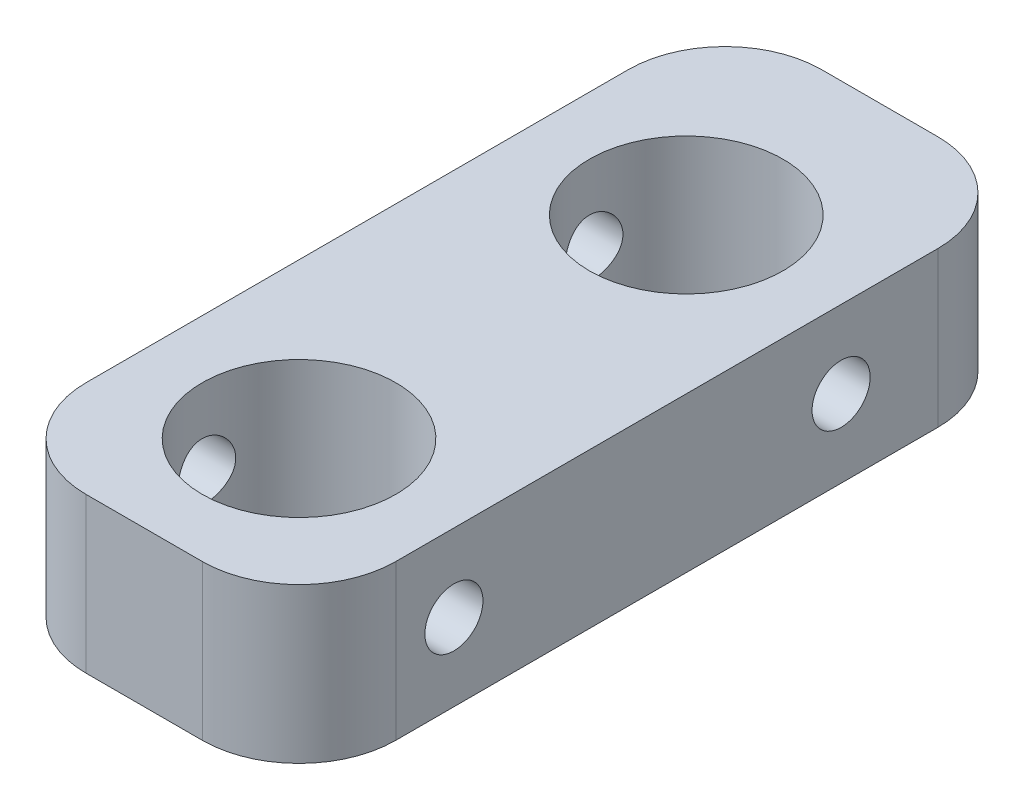
ISO-10303-21;
HEADER;
FILE_DESCRIPTION(('STEP AP214'),'2;1');
FILE_NAME('part.step','',(''),(''),'','','');
FILE_SCHEMA(('AUTOMOTIVE_DESIGN { 1 0 10303 214 1 1 1 1 }'));
ENDSEC;
DATA;
#1=APPLICATION_CONTEXT('core data for automotive mechanical design processes');
#2=APPLICATION_PROTOCOL_DEFINITION('international standard','automotive_design',2000,#1);
#3=PRODUCT_CONTEXT('',#1,'mechanical');
#4=PRODUCT('Part','Part','',(#3));
#5=PRODUCT_RELATED_PRODUCT_CATEGORY('part','',(#4));
#6=PRODUCT_DEFINITION_FORMATION('','',#4);
#7=PRODUCT_DEFINITION_CONTEXT('part definition',#1,'design');
#8=PRODUCT_DEFINITION('design','',#6,#7);
#9=PRODUCT_DEFINITION_SHAPE('','',#8);
#10=(LENGTH_UNIT() NAMED_UNIT(*) SI_UNIT(.MILLI.,.METRE.));
#11=(NAMED_UNIT(*) PLANE_ANGLE_UNIT() SI_UNIT($,.RADIAN.));
#12=(NAMED_UNIT(*) SI_UNIT($,.STERADIAN.) SOLID_ANGLE_UNIT());
#13=UNCERTAINTY_MEASURE_WITH_UNIT(LENGTH_MEASURE(1.E-05),#10,'distance_accuracy_value','');
#14=(GEOMETRIC_REPRESENTATION_CONTEXT(3) GLOBAL_UNCERTAINTY_ASSIGNED_CONTEXT((#13)) GLOBAL_UNIT_ASSIGNED_CONTEXT((#10,
#11,#12)) REPRESENTATION_CONTEXT('',''));
#15=CARTESIAN_POINT('',(0.,0.,0.));
#16=DIRECTION('',(0.,0.,1.));
#17=DIRECTION('',(1.,0.,0.));
#18=AXIS2_PLACEMENT_3D('',#15,#16,#17);
#19=CARTESIAN_POINT('',(3.32639814546508,8.,30.3793103448276));
#20=DIRECTION('',(0.,1.,0.));
#21=DIRECTION('',(0.,0.,1.));
#22=AXIS2_PLACEMENT_3D('',#19,#20,#21);
#23=PLANE('',#22);
#24=CARTESIAN_POINT('',(0.326398145465083,8.,27.3793103448276));
#25=DIRECTION('',(0.,1.,0.));
#26=DIRECTION('',(0.,0.,1.));
#27=AXIS2_PLACEMENT_3D('',#24,#25,#26);
#28=CIRCLE('',#27,5.);
#29=CARTESIAN_POINT('',(0.326398145465083,8.,32.3793103448276));
#30=VERTEX_POINT('',#29);
#31=EDGE_CURVE('E155',#30,#30,#28,.T.);
#32=ORIENTED_EDGE('',*,*,#31,.F.);
#33=EDGE_LOOP('',(#32));
#34=FACE_BOUND('',#33,.T.);
#35=CARTESIAN_POINT('',(3.32639814546508,8.,30.3793103448276));
#36=DIRECTION('',(0.,1.,0.));
#37=DIRECTION('',(0.,0.,1.));
#38=AXIS2_PLACEMENT_3D('',#35,#36,#37);
#39=CIRCLE('',#38,5.);
#40=CARTESIAN_POINT('',(3.32639814546505,8.,35.3793103448276));
#41=VERTEX_POINT('',#40);
#42=CARTESIAN_POINT('',(8.32639814546508,8.,30.3793103448276));
#43=VERTEX_POINT('',#42);
#44=EDGE_CURVE('E173',#41,#43,#39,.T.);
#45=ORIENTED_EDGE('',*,*,#44,.T.);
#46=DIRECTION('',(0.,0.,-1.));
#47=VECTOR('',#46,1.);
#48=CARTESIAN_POINT('',(8.32639814546508,8.,30.3793103448276));
#49=LINE('',#48,#47);
#50=CARTESIAN_POINT('',(8.32639814546508,8.,2.37931034482762));
#51=VERTEX_POINT('',#50);
#52=EDGE_CURVE('E109',#43,#51,#49,.T.);
#53=ORIENTED_EDGE('',*,*,#52,.T.);
#54=CARTESIAN_POINT('',(3.32639814546508,8.,2.37931034482759));
#55=DIRECTION('',(0.,1.,0.));
#56=DIRECTION('',(0.,0.,-1.));
#57=AXIS2_PLACEMENT_3D('',#54,#55,#56);
#58=CIRCLE('',#57,5.);
#59=CARTESIAN_POINT('',(3.32639814546505,8.,-2.62068965517241));
#60=VERTEX_POINT('',#59);
#61=EDGE_CURVE('E276',#51,#60,#58,.T.);
#62=ORIENTED_EDGE('',*,*,#61,.T.);
#63=DIRECTION('',(-1.,0.,0.));
#64=VECTOR('',#63,1.);
#65=CARTESIAN_POINT('',(-2.67360185453488,8.,-2.62068965517241));
#66=LINE('',#65,#64);
#67=CARTESIAN_POINT('',(-2.67360185453492,8.,-2.62068965517241));
#68=VERTEX_POINT('',#67);
#69=EDGE_CURVE('E283',#60,#68,#66,.T.);
#70=ORIENTED_EDGE('',*,*,#69,.T.);
#71=CARTESIAN_POINT('',(-2.67360185453492,8.,2.37931034482759));
#72=DIRECTION('',(0.,1.,0.));
#73=DIRECTION('',(0.,0.,-1.));
#74=AXIS2_PLACEMENT_3D('',#71,#72,#73);
#75=CIRCLE('',#74,5.);
#76=CARTESIAN_POINT('',(-7.67360185453492,8.,2.37931034482762));
#77=VERTEX_POINT('',#76);
#78=EDGE_CURVE('E128',#68,#77,#75,.T.);
#79=ORIENTED_EDGE('',*,*,#78,.T.);
#80=DIRECTION('',(0.,0.,1.));
#81=VECTOR('',#80,1.);
#82=CARTESIAN_POINT('',(-7.67360185453492,8.,30.3793103448276));
#83=LINE('',#82,#81);
#84=CARTESIAN_POINT('',(-7.67360185453492,8.,30.3793103448276));
#85=VERTEX_POINT('',#84);
#86=EDGE_CURVE('E122',#77,#85,#83,.T.);
#87=ORIENTED_EDGE('',*,*,#86,.T.);
#88=CARTESIAN_POINT('',(-2.67360185453492,8.,30.3793103448276));
#89=DIRECTION('',(0.,1.,0.));
#90=DIRECTION('',(0.,0.,-1.));
#91=AXIS2_PLACEMENT_3D('',#88,#89,#90);
#92=CIRCLE('',#91,5.);
#93=CARTESIAN_POINT('',(-2.67360185453488,8.,35.3793103448276));
#94=VERTEX_POINT('',#93);
#95=EDGE_CURVE('E126',#85,#94,#92,.T.);
#96=ORIENTED_EDGE('',*,*,#95,.T.);
#97=DIRECTION('',(1.,0.,0.));
#98=VECTOR('',#97,1.);
#99=CARTESIAN_POINT('',(-2.67360185453488,8.,35.3793103448276));
#100=LINE('',#99,#98);
#101=EDGE_CURVE('E66',#94,#41,#100,.T.);
#102=ORIENTED_EDGE('',*,*,#101,.T.);
#103=EDGE_LOOP('',(#45,#53,#62,#70,#79,#87,#96,#102));
#104=FACE_BOUND('',#103,.T.);
#105=CARTESIAN_POINT('',(0.326398145465083,8.,7.37931034482758));
#106=DIRECTION('',(0.,1.,0.));
#107=DIRECTION('',(0.,0.,1.));
#108=AXIS2_PLACEMENT_3D('',#105,#106,#107);
#109=CIRCLE('',#108,5.);
#110=CARTESIAN_POINT('',(0.326398145465083,8.,12.3793103448276));
#111=VERTEX_POINT('',#110);
#112=EDGE_CURVE('E297',#111,#111,#109,.T.);
#113=ORIENTED_EDGE('',*,*,#112,.F.);
#114=EDGE_LOOP('',(#113));
#115=FACE_BOUND('',#114,.T.);
#116=ADVANCED_FACE('F41',(#34,#104,#115),#23,.T.);
#117=CARTESIAN_POINT('',(3.32639814546508,0.,30.3793103448276));
#118=DIRECTION('',(0.,1.,0.));
#119=DIRECTION('',(0.,0.,1.));
#120=AXIS2_PLACEMENT_3D('',#117,#118,#119);
#121=PLANE('',#120);
#122=CARTESIAN_POINT('',(3.32639814546508,0.,30.3793103448276));
#123=DIRECTION('',(0.,1.,0.));
#124=DIRECTION('',(0.,0.,1.));
#125=AXIS2_PLACEMENT_3D('',#122,#123,#124);
#126=CIRCLE('',#125,5.);
#127=CARTESIAN_POINT('',(3.32639814546505,0.,35.3793103448276));
#128=VERTEX_POINT('',#127);
#129=CARTESIAN_POINT('',(8.32639814546508,0.,30.3793103448276));
#130=VERTEX_POINT('',#129);
#131=EDGE_CURVE('E150',#128,#130,#126,.T.);
#132=ORIENTED_EDGE('',*,*,#131,.F.);
#133=DIRECTION('',(1.,0.,0.));
#134=VECTOR('',#133,1.);
#135=CARTESIAN_POINT('',(-2.67360185453488,0.,35.3793103448276));
#136=LINE('',#135,#134);
#137=CARTESIAN_POINT('',(-2.67360185453488,0.,35.3793103448276));
#138=VERTEX_POINT('',#137);
#139=EDGE_CURVE('E101',#138,#128,#136,.T.);
#140=ORIENTED_EDGE('',*,*,#139,.F.);
#141=CARTESIAN_POINT('',(-2.67360185453492,0.,30.3793103448276));
#142=DIRECTION('',(0.,1.,0.));
#143=DIRECTION('',(0.,0.,-1.));
#144=AXIS2_PLACEMENT_3D('',#141,#142,#143);
#145=CIRCLE('',#144,5.);
#146=CARTESIAN_POINT('',(-7.67360185453492,0.,30.3793103448276));
#147=VERTEX_POINT('',#146);
#148=EDGE_CURVE('E95',#147,#138,#145,.T.);
#149=ORIENTED_EDGE('',*,*,#148,.F.);
#150=DIRECTION('',(0.,0.,1.));
#151=VECTOR('',#150,1.);
#152=CARTESIAN_POINT('',(-7.67360185453492,0.,30.3793103448276));
#153=LINE('',#152,#151);
#154=CARTESIAN_POINT('',(-7.67360185453492,0.,2.37931034482762));
#155=VERTEX_POINT('',#154);
#156=EDGE_CURVE('E137',#155,#147,#153,.T.);
#157=ORIENTED_EDGE('',*,*,#156,.F.);
#158=CARTESIAN_POINT('',(-2.67360185453492,0.,2.37931034482759));
#159=DIRECTION('',(0.,1.,0.));
#160=DIRECTION('',(0.,0.,-1.));
#161=AXIS2_PLACEMENT_3D('',#158,#159,#160);
#162=CIRCLE('',#161,5.);
#163=CARTESIAN_POINT('',(-2.67360185453492,0.,-2.62068965517241));
#164=VERTEX_POINT('',#163);
#165=EDGE_CURVE('E164',#164,#155,#162,.T.);
#166=ORIENTED_EDGE('',*,*,#165,.F.);
#167=DIRECTION('',(-1.,0.,0.));
#168=VECTOR('',#167,1.);
#169=CARTESIAN_POINT('',(-2.67360185453488,0.,-2.62068965517241));
#170=LINE('',#169,#168);
#171=CARTESIAN_POINT('',(3.32639814546505,0.,-2.62068965517241));
#172=VERTEX_POINT('',#171);
#173=EDGE_CURVE('E161',#172,#164,#170,.T.);
#174=ORIENTED_EDGE('',*,*,#173,.F.);
#175=CARTESIAN_POINT('',(3.32639814546508,0.,2.37931034482759));
#176=DIRECTION('',(0.,1.,0.));
#177=DIRECTION('',(0.,0.,-1.));
#178=AXIS2_PLACEMENT_3D('',#175,#176,#177);
#179=CIRCLE('',#178,5.);
#180=CARTESIAN_POINT('',(8.32639814546508,0.,2.37931034482762));
#181=VERTEX_POINT('',#180);
#182=EDGE_CURVE('E158',#181,#172,#179,.T.);
#183=ORIENTED_EDGE('',*,*,#182,.F.);
#184=DIRECTION('',(0.,0.,-1.));
#185=VECTOR('',#184,1.);
#186=CARTESIAN_POINT('',(8.32639814546508,0.,30.3793103448276));
#187=LINE('',#186,#185);
#188=EDGE_CURVE('E154',#130,#181,#187,.T.);
#189=ORIENTED_EDGE('',*,*,#188,.F.);
#190=EDGE_LOOP('',(#132,#140,#149,#157,#166,#174,#183,#189));
#191=FACE_BOUND('',#190,.T.);
#192=CARTESIAN_POINT('',(0.326398145465083,0.,27.3793103448276));
#193=DIRECTION('',(0.,1.,0.));
#194=DIRECTION('',(0.,0.,1.));
#195=AXIS2_PLACEMENT_3D('',#192,#193,#194);
#196=CIRCLE('',#195,5.);
#197=CARTESIAN_POINT('',(0.326398145465083,0.,32.3793103448276));
#198=VERTEX_POINT('',#197);
#199=EDGE_CURVE('E293',#198,#198,#196,.T.);
#200=ORIENTED_EDGE('',*,*,#199,.T.);
#201=EDGE_LOOP('',(#200));
#202=FACE_BOUND('',#201,.T.);
#203=CARTESIAN_POINT('',(0.326398145465083,0.,7.37931034482758));
#204=DIRECTION('',(0.,1.,0.));
#205=DIRECTION('',(0.,0.,1.));
#206=AXIS2_PLACEMENT_3D('',#203,#204,#205);
#207=CIRCLE('',#206,5.);
#208=CARTESIAN_POINT('',(0.326398145465083,0.,12.3793103448276));
#209=VERTEX_POINT('',#208);
#210=EDGE_CURVE('E301',#209,#209,#207,.T.);
#211=ORIENTED_EDGE('',*,*,#210,.T.);
#212=EDGE_LOOP('',(#211));
#213=FACE_BOUND('',#212,.T.);
#214=ADVANCED_FACE('F234',(#191,#202,#213),#121,.F.);
#215=CARTESIAN_POINT('',(3.32639814546508,8.,30.3793103448276));
#216=DIRECTION('',(0.,-1.,0.));
#217=DIRECTION('',(0.,0.,-1.));
#218=AXIS2_PLACEMENT_3D('',#215,#216,#217);
#219=CYLINDRICAL_SURFACE('',#218,5.);
#220=ORIENTED_EDGE('',*,*,#131,.T.);
#221=DIRECTION('',(0.,-1.,0.));
#222=VECTOR('',#221,1.);
#223=CARTESIAN_POINT('',(8.32639814546508,8.,30.3793103448276));
#224=LINE('',#223,#222);
#225=EDGE_CURVE('E11',#43,#130,#224,.T.);
#226=ORIENTED_EDGE('',*,*,#225,.F.);
#227=ORIENTED_EDGE('',*,*,#44,.F.);
#228=DIRECTION('',(0.,-1.,0.));
#229=VECTOR('',#228,1.);
#230=CARTESIAN_POINT('',(3.32639814546505,8.,35.3793103448276));
#231=LINE('',#230,#229);
#232=EDGE_CURVE('E146',#41,#128,#231,.T.);
#233=ORIENTED_EDGE('',*,*,#232,.T.);
#234=EDGE_LOOP('',(#220,#226,#227,#233));
#235=FACE_BOUND('',#234,.T.);
#236=ADVANCED_FACE('F43',(#235),#219,.T.);
#237=CARTESIAN_POINT('',(8.32639814546508,8.,30.3793103448276));
#238=DIRECTION('',(-1.,0.,0.));
#239=DIRECTION('',(0.,0.,1.));
#240=AXIS2_PLACEMENT_3D('',#237,#238,#239);
#241=PLANE('',#240);
#242=CARTESIAN_POINT('',(8.32639814546508,4.,27.3793103448276));
#243=DIRECTION('',(1.,0.,0.));
#244=DIRECTION('',(0.,0.,-1.));
#245=AXIS2_PLACEMENT_3D('',#242,#243,#244);
#246=CIRCLE('',#245,1.5);
#247=CARTESIAN_POINT('',(8.32639814546508,4.,25.8793103448276));
#248=VERTEX_POINT('',#247);
#249=EDGE_CURVE('E267',#248,#248,#246,.T.);
#250=ORIENTED_EDGE('',*,*,#249,.F.);
#251=EDGE_LOOP('',(#250));
#252=FACE_BOUND('',#251,.T.);
#253=CARTESIAN_POINT('',(8.32639814546508,4.,7.37931034482759));
#254=DIRECTION('',(1.,0.,0.));
#255=DIRECTION('',(0.,0.,1.));
#256=AXIS2_PLACEMENT_3D('',#253,#254,#255);
#257=CIRCLE('',#256,1.5);
#258=CARTESIAN_POINT('',(8.32639814546508,4.,8.87931034482759));
#259=VERTEX_POINT('',#258);
#260=EDGE_CURVE('E270',#259,#259,#257,.T.);
#261=ORIENTED_EDGE('',*,*,#260,.F.);
#262=EDGE_LOOP('',(#261));
#263=FACE_BOUND('',#262,.T.);
#264=ORIENTED_EDGE('',*,*,#188,.T.);
#265=DIRECTION('',(0.,-1.,0.));
#266=VECTOR('',#265,1.);
#267=CARTESIAN_POINT('',(8.32639814546508,8.,2.37931034482762));
#268=LINE('',#267,#266);
#269=EDGE_CURVE('E57',#51,#181,#268,.T.);
#270=ORIENTED_EDGE('',*,*,#269,.F.);
#271=ORIENTED_EDGE('',*,*,#52,.F.);
#272=ORIENTED_EDGE('',*,*,#225,.T.);
#273=EDGE_LOOP('',(#264,#270,#271,#272));
#274=FACE_BOUND('',#273,.T.);
#275=ADVANCED_FACE('F256',(#252,#263,#274),#241,.F.);
#276=CARTESIAN_POINT('',(3.32639814546508,8.,2.37931034482759));
#277=DIRECTION('',(0.,-1.,0.));
#278=DIRECTION('',(0.,0.,-1.));
#279=AXIS2_PLACEMENT_3D('',#276,#277,#278);
#280=CYLINDRICAL_SURFACE('',#279,5.);
#281=ORIENTED_EDGE('',*,*,#182,.T.);
#282=DIRECTION('',(0.,-1.,0.));
#283=VECTOR('',#282,1.);
#284=CARTESIAN_POINT('',(3.32639814546505,8.,-2.62068965517241));
#285=LINE('',#284,#283);
#286=EDGE_CURVE('E184',#60,#172,#285,.T.);
#287=ORIENTED_EDGE('',*,*,#286,.F.);
#288=ORIENTED_EDGE('',*,*,#61,.F.);
#289=ORIENTED_EDGE('',*,*,#269,.T.);
#290=EDGE_LOOP('',(#281,#287,#288,#289));
#291=FACE_BOUND('',#290,.T.);
#292=ADVANCED_FACE('F253',(#291),#280,.T.);
#293=CARTESIAN_POINT('',(-2.67360185453488,8.,-2.62068965517241));
#294=DIRECTION('',(0.,0.,1.));
#295=DIRECTION('',(1.,0.,0.));
#296=AXIS2_PLACEMENT_3D('',#293,#294,#295);
#297=PLANE('',#296);
#298=ORIENTED_EDGE('',*,*,#173,.T.);
#299=DIRECTION('',(0.,-1.,0.));
#300=VECTOR('',#299,1.);
#301=CARTESIAN_POINT('',(-2.67360185453492,8.,-2.62068965517241));
#302=LINE('',#301,#300);
#303=EDGE_CURVE('E180',#68,#164,#302,.T.);
#304=ORIENTED_EDGE('',*,*,#303,.F.);
#305=ORIENTED_EDGE('',*,*,#69,.F.);
#306=ORIENTED_EDGE('',*,*,#286,.T.);
#307=EDGE_LOOP('',(#298,#304,#305,#306));
#308=FACE_BOUND('',#307,.T.);
#309=ADVANCED_FACE('F249',(#308),#297,.F.);
#310=CARTESIAN_POINT('',(-2.67360185453492,8.,2.37931034482759));
#311=DIRECTION('',(0.,-1.,0.));
#312=DIRECTION('',(0.,0.,-1.));
#313=AXIS2_PLACEMENT_3D('',#310,#311,#312);
#314=CYLINDRICAL_SURFACE('',#313,5.);
#315=ORIENTED_EDGE('',*,*,#165,.T.);
#316=DIRECTION('',(0.,-1.,0.));
#317=VECTOR('',#316,1.);
#318=CARTESIAN_POINT('',(-7.67360185453492,8.,2.37931034482762));
#319=LINE('',#318,#317);
#320=EDGE_CURVE('E139',#77,#155,#319,.T.);
#321=ORIENTED_EDGE('',*,*,#320,.F.);
#322=ORIENTED_EDGE('',*,*,#78,.F.);
#323=ORIENTED_EDGE('',*,*,#303,.T.);
#324=EDGE_LOOP('',(#315,#321,#322,#323));
#325=FACE_BOUND('',#324,.T.);
#326=ADVANCED_FACE('F245',(#325),#314,.T.);
#327=CARTESIAN_POINT('',(-7.67360185453492,8.,30.3793103448276));
#328=DIRECTION('',(1.,0.,0.));
#329=DIRECTION('',(0.,0.,-1.));
#330=AXIS2_PLACEMENT_3D('',#327,#328,#329);
#331=PLANE('',#330);
#332=CARTESIAN_POINT('',(-7.67360185453492,4.,27.3793103448276));
#333=DIRECTION('',(1.,0.,0.));
#334=DIRECTION('',(0.,0.,-1.));
#335=AXIS2_PLACEMENT_3D('',#332,#333,#334);
#336=CIRCLE('',#335,1.5);
#337=CARTESIAN_POINT('',(-7.67360185453492,4.,25.8793103448276));
#338=VERTEX_POINT('',#337);
#339=EDGE_CURVE('E201',#338,#338,#336,.T.);
#340=ORIENTED_EDGE('',*,*,#339,.T.);
#341=EDGE_LOOP('',(#340));
#342=FACE_BOUND('',#341,.T.);
#343=CARTESIAN_POINT('',(-7.67360185453492,4.,7.37931034482759));
#344=DIRECTION('',(1.,0.,0.));
#345=DIRECTION('',(0.,0.,1.));
#346=AXIS2_PLACEMENT_3D('',#343,#344,#345);
#347=CIRCLE('',#346,1.5);
#348=CARTESIAN_POINT('',(-7.67360185453492,4.,8.87931034482759));
#349=VERTEX_POINT('',#348);
#350=EDGE_CURVE('E310',#349,#349,#347,.T.);
#351=ORIENTED_EDGE('',*,*,#350,.T.);
#352=EDGE_LOOP('',(#351));
#353=FACE_BOUND('',#352,.T.);
#354=ORIENTED_EDGE('',*,*,#156,.T.);
#355=DIRECTION('',(0.,-1.,0.));
#356=VECTOR('',#355,1.);
#357=CARTESIAN_POINT('',(-7.67360185453492,8.,30.3793103448276));
#358=LINE('',#357,#356);
#359=EDGE_CURVE('E134',#85,#147,#358,.T.);
#360=ORIENTED_EDGE('',*,*,#359,.F.);
#361=ORIENTED_EDGE('',*,*,#86,.F.);
#362=ORIENTED_EDGE('',*,*,#320,.T.);
#363=EDGE_LOOP('',(#354,#360,#361,#362));
#364=FACE_BOUND('',#363,.T.);
#365=ADVANCED_FACE('F135',(#342,#353,#364),#331,.F.);
#366=CARTESIAN_POINT('',(-2.67360185453492,8.,30.3793103448276));
#367=DIRECTION('',(0.,-1.,0.));
#368=DIRECTION('',(0.,0.,-1.));
#369=AXIS2_PLACEMENT_3D('',#366,#367,#368);
#370=CYLINDRICAL_SURFACE('',#369,5.);
#371=ORIENTED_EDGE('',*,*,#148,.T.);
#372=DIRECTION('',(0.,-1.,0.));
#373=VECTOR('',#372,1.);
#374=CARTESIAN_POINT('',(-2.67360185453488,8.,35.3793103448276));
#375=LINE('',#374,#373);
#376=EDGE_CURVE('E140',#94,#138,#375,.T.);
#377=ORIENTED_EDGE('',*,*,#376,.F.);
#378=ORIENTED_EDGE('',*,*,#95,.F.);
#379=ORIENTED_EDGE('',*,*,#359,.T.);
#380=EDGE_LOOP('',(#371,#377,#378,#379));
#381=FACE_BOUND('',#380,.T.);
#382=ADVANCED_FACE('F142',(#381),#370,.T.);
#383=CARTESIAN_POINT('',(-2.67360185453488,8.,35.3793103448276));
#384=DIRECTION('',(0.,0.,-1.));
#385=DIRECTION('',(-1.,0.,0.));
#386=AXIS2_PLACEMENT_3D('',#383,#384,#385);
#387=PLANE('',#386);
#388=ORIENTED_EDGE('',*,*,#139,.T.);
#389=ORIENTED_EDGE('',*,*,#232,.F.);
#390=ORIENTED_EDGE('',*,*,#101,.F.);
#391=ORIENTED_EDGE('',*,*,#376,.T.);
#392=EDGE_LOOP('',(#388,#389,#390,#391));
#393=FACE_BOUND('',#392,.T.);
#394=ADVANCED_FACE('F229',(#393),#387,.F.);
#395=CARTESIAN_POINT('',(0.326398145465083,8.,27.3793103448276));
#396=DIRECTION('',(0.,-1.,0.));
#397=DIRECTION('',(0.,0.,-1.));
#398=AXIS2_PLACEMENT_3D('',#395,#396,#397);
#399=CYLINDRICAL_SURFACE('',#398,5.);
#400=CARTESIAN_POINT('',(-4.44329786161965,4.,25.8793103448276));
#401=CARTESIAN_POINT('',(-4.44329871180472,4.0821945479424,25.8793113684899));
#402=CARTESIAN_POINT('',(-4.44544575662561,4.16439922414402,25.8860892631562));
#403=CARTESIAN_POINT('',(-4.45376763756392,4.32640524959194,25.9129519003601));
#404=CARTESIAN_POINT('',(-4.4599438194696,4.40620578650147,25.9330410890918));
#405=CARTESIAN_POINT('',(-4.47556287939124,4.56103472827173,25.985782812128));
#406=CARTESIAN_POINT('',(-4.48500032156724,4.63607082963309,26.0184144508852));
#407=CARTESIAN_POINT('',(-4.50607118001059,4.7796219339953,26.0952461256483));
#408=CARTESIAN_POINT('',(-4.51770492494511,4.84813595868444,26.1394478934571));
#409=CARTESIAN_POINT('',(-4.54227047639257,4.97886639057737,26.2396628034113));
#410=CARTESIAN_POINT('',(-4.55522993765127,5.04084589794629,26.2959782730695));
#411=CARTESIAN_POINT('',(-4.58075047390249,5.15463795132251,26.418174107248));
#412=CARTESIAN_POINT('',(-4.59331149751197,5.20644919044988,26.4840556993665));
#413=CARTESIAN_POINT('',(-4.61693400032881,5.29946269983331,26.6251989070339));
#414=CARTESIAN_POINT('',(-4.62795909795896,5.34042342444281,26.7006263234918));
#415=CARTESIAN_POINT('',(-4.64694621374176,5.40898725904276,26.8576856994582));
#416=CARTESIAN_POINT('',(-4.65490889242987,5.43659324985745,26.9393163164397));
#417=CARTESIAN_POINT('',(-4.66667831457081,5.47688000109051,27.1039864921968));
#418=CARTESIAN_POINT('',(-4.6705974282283,5.4899651276527,27.1869189458738));
#419=CARTESIAN_POINT('',(-4.6742338695484,5.50211732464644,27.3538885210783));
#420=CARTESIAN_POINT('',(-4.67395207974571,5.50118733940196,27.437925406878));
#421=CARTESIAN_POINT('',(-4.6692978927115,5.48560713145698,27.6018815014277));
#422=CARTESIAN_POINT('',(-4.66505605658752,5.47139480619013,27.6818466124689));
#423=CARTESIAN_POINT('',(-4.65311707566085,5.43036866400571,27.8381995582701));
#424=CARTESIAN_POINT('',(-4.64541971204078,5.40355404905733,27.9145871661504));
#425=CARTESIAN_POINT('',(-4.62725406440455,5.33778797658144,28.0626576711789));
#426=CARTESIAN_POINT('',(-4.61675455130197,5.29869879719273,28.1342754095221));
#427=CARTESIAN_POINT('',(-4.59409826101561,5.20960214757177,28.2700750186107));
#428=CARTESIAN_POINT('',(-4.5819410909127,5.15959208703652,28.3342551196997));
#429=CARTESIAN_POINT('',(-4.55671735941657,5.0478022492484,28.4559708263574));
#430=CARTESIAN_POINT('',(-4.54363380774953,4.98564308097026,28.5131549252287));
#431=CARTESIAN_POINT('',(-4.51844165340989,4.85248998210995,28.6163868602258));
#432=CARTESIAN_POINT('',(-4.50633314770512,4.78149517461077,28.6624335896561));
#433=CARTESIAN_POINT('',(-4.48438088651169,4.63176053075101,28.7424502981821));
#434=CARTESIAN_POINT('',(-4.47455996149448,4.55295295413708,28.7763002372044));
#435=CARTESIAN_POINT('',(-4.45856578001928,4.39039279155446,28.8301439736117));
#436=CARTESIAN_POINT('',(-4.45239133369321,4.30664182846544,28.8501422912332));
#437=CARTESIAN_POINT('',(-4.44465034994733,4.13991763926072,28.8750580476492));
#438=CARTESIAN_POINT('',(-4.44292064123932,4.05703177610602,28.8805098086297));
#439=CARTESIAN_POINT('',(-4.44381377895416,3.89152709999013,28.8776698171582));
#440=CARTESIAN_POINT('',(-4.44643601610081,3.80890825126915,28.8693799885409));
#441=CARTESIAN_POINT('',(-4.45557744008404,3.64851162202913,28.8397679805695));
#442=CARTESIAN_POINT('',(-4.4619936196098,3.57066383573648,28.8187899591404));
#443=CARTESIAN_POINT('',(-4.47789326684719,3.41959830918508,28.764796122307));
#444=CARTESIAN_POINT('',(-4.48737720812565,3.34638128585943,28.7317784482552));
#445=CARTESIAN_POINT('',(-4.50866020476539,3.20448253592787,28.6536290567926));
#446=CARTESIAN_POINT('',(-4.5205145652329,3.13597527901421,28.6081959865549));
#447=CARTESIAN_POINT('',(-4.54508391100479,3.0073618938192,28.5068633608314));
#448=CARTESIAN_POINT('',(-4.55779910183495,2.94725778238721,28.4509613001766));
#449=CARTESIAN_POINT('',(-4.5832381900165,2.83481959418526,28.3277654773212));
#450=CARTESIAN_POINT('',(-4.59594430516496,2.78286437101302,28.260121410685));
#451=CARTESIAN_POINT('',(-4.61945037202142,2.69103329897225,28.1167721294178));
#452=CARTESIAN_POINT('',(-4.63025041838209,2.65115685021854,28.0410673153715));
#453=CARTESIAN_POINT('',(-4.64866155928449,2.5849999694317,27.8842458495328));
#454=CARTESIAN_POINT('',(-4.65629638878457,2.55861798384102,27.8031749668654));
#455=CARTESIAN_POINT('',(-4.66762165050319,2.51993908110958,27.6374803113322));
#456=CARTESIAN_POINT('',(-4.67131321124372,2.50763813405158,27.5528575621823));
#457=CARTESIAN_POINT('',(-4.67426729534891,2.4977769559455,27.3859624987103));
#458=CARTESIAN_POINT('',(-4.67369490564814,2.49966730459217,27.3037251657414));
#459=CARTESIAN_POINT('',(-4.66857449918528,2.51682163249912,27.1407908636632));
#460=CARTESIAN_POINT('',(-4.66402670783954,2.53208485348044,27.0600938074811));
#461=CARTESIAN_POINT('',(-4.65151353811818,2.57521166139962,26.9033745317862));
#462=CARTESIAN_POINT('',(-4.64358538354358,2.60293818064901,26.8273114174762));
#463=CARTESIAN_POINT('',(-4.62513128492942,2.67008191450719,26.6808771070755));
#464=CARTESIAN_POINT('',(-4.61460491403438,2.70950105028619,26.610506848777));
#465=CARTESIAN_POINT('',(-4.5916415128172,2.80037345743004,26.475008452407));
#466=CARTESIAN_POINT('',(-4.57915412377051,2.85217143000077,26.4101200947508));
#467=CARTESIAN_POINT('',(-4.55383722665826,2.9657103883328,26.2897727734816));
#468=CARTESIAN_POINT('',(-4.54100762094571,3.02745423789815,26.2343165352257));
#469=CARTESIAN_POINT('',(-4.51600866084811,3.16134077831051,26.1327476508821));
#470=CARTESIAN_POINT('',(-4.50387038146977,3.23373855339044,26.086962747248));
#471=CARTESIAN_POINT('',(-4.48212732962285,3.38555517416102,26.0082672095398));
#472=CARTESIAN_POINT('',(-4.47252134050447,3.46497062360119,25.9753503892547));
#473=CARTESIAN_POINT('',(-4.45788002171086,3.61974043160627,25.9262909194981));
#474=CARTESIAN_POINT('',(-4.45246340294012,3.69460864693099,25.9087217547153));
#475=CARTESIAN_POINT('',(-4.44517228050658,3.84631522249577,25.8852321564761));
#476=CARTESIAN_POINT('',(-4.44329706674922,3.92315318464525,25.8793093877666));
#477=CARTESIAN_POINT('',(-4.44329786161965,4.,25.8793103448276));
#478=B_SPLINE_CURVE_WITH_KNOTS('',3,(#400,#401,#402,#403,#404,#405,#406,#407,#408,#409,#410,
#411,#412,#413,#414,#415,#416,#417,#418,#419,#420,#421,#422,#423,#424,#425,#426,#427,#428,#429,
#430,#431,#432,#433,#434,#435,#436,#437,#438,#439,#440,#441,#442,#443,#444,#445,#446,#447,#448,
#449,#450,#451,#452,#453,#454,#455,#456,#457,#458,#459,#460,#461,#462,#463,#464,#465,#466,#467,
#468,#469,#470,#471,#472,#473,#474,#475,#476,#477),.UNSPECIFIED.,.T.,.F.,(4,2,2,2,2,2,2,2,2,2,2,
2,2,2,2,2,2,2,2,2,2,2,2,2,2,2,2,2,2,2,2,2,2,2,2,2,2,2,4),(0.,0.246300165915543,0.492682641689,
0.738656414466194,0.984667025370101,1.23773150007984,1.49082847871273,1.74915939273645,
2.00743455587877,2.25832140149558,2.5091555410144,2.7520012599088,2.99486235890376,
3.24055209335676,3.48630016590831,3.74152147023278,3.99676812491863,4.25446238246266,
4.51207250628411,4.76008080790309,5.00805439107388,5.24958594938817,5.49115481045787,
5.73920731809388,5.98731925928923,6.24479506100602,6.50225807324202,6.75775391814325,
7.01317662321683,7.25876303911221,7.50433553047755,7.74727096872219,7.99024634491379,
8.24099627054489,8.49181852629891,8.75011639669147,9.00828993963944,9.23861153857448,
9.4688869503356),.UNSPECIFIED.);
#479=CARTESIAN_POINT('',(-4.44329786161965,4.,25.8793103448276));
#480=VERTEX_POINT('',#479);
#481=EDGE_CURVE('E45',#480,#480,#478,.T.);
#482=ORIENTED_EDGE('',*,*,#481,.F.);
#483=EDGE_LOOP('',(#482));
#484=FACE_BOUND('',#483,.T.);
#485=CARTESIAN_POINT('',(5.09609415254981,4.,25.8793103448276));
#486=CARTESIAN_POINT('',(5.09609500273488,3.9178054520576,25.8793113684899));
#487=CARTESIAN_POINT('',(5.09824204755577,3.83560077585598,25.8860892631562));
#488=CARTESIAN_POINT('',(5.10656392849408,3.67359475040806,25.9129519003601));
#489=CARTESIAN_POINT('',(5.11274011039976,3.59379421349853,25.9330410890918));
#490=CARTESIAN_POINT('',(5.12835917032141,3.43896527172827,25.985782812128));
#491=CARTESIAN_POINT('',(5.13779661249741,3.36392917036691,26.0184144508852));
#492=CARTESIAN_POINT('',(5.15886747094075,3.2203780660047,26.0952461256483));
#493=CARTESIAN_POINT('',(5.17050121587528,3.15186404131556,26.1394478934571));
#494=CARTESIAN_POINT('',(5.19506676732274,3.02113360942262,26.2396628034113));
#495=CARTESIAN_POINT('',(5.20802622858144,2.95915410205371,26.2959782730695));
#496=CARTESIAN_POINT('',(5.23354676483265,2.84536204867749,26.418174107248));
#497=CARTESIAN_POINT('',(5.24610778844213,2.79355080955012,26.4840556993665));
#498=CARTESIAN_POINT('',(5.26973029125897,2.70053730016669,26.6251989070339));
#499=CARTESIAN_POINT('',(5.28075538888913,2.65957657555719,26.7006263234918));
#500=CARTESIAN_POINT('',(5.29974250467193,2.59101274095724,26.8576856994582));
#501=CARTESIAN_POINT('',(5.30770518336004,2.56340675014255,26.9393163164397));
#502=CARTESIAN_POINT('',(5.31947460550098,2.52311999890949,27.1039864921968));
#503=CARTESIAN_POINT('',(5.32339371915847,2.5100348723473,27.1869189458738));
#504=CARTESIAN_POINT('',(5.32703016047856,2.49788267535356,27.3538885210783));
#505=CARTESIAN_POINT('',(5.32674837067587,2.49881266059804,27.437925406878));
#506=CARTESIAN_POINT('',(5.32209418364167,2.51439286854302,27.6018815014277));
#507=CARTESIAN_POINT('',(5.31785234751769,2.52860519380987,27.6818466124689));
#508=CARTESIAN_POINT('',(5.30591336659101,2.56963133599429,27.8381995582701));
#509=CARTESIAN_POINT('',(5.29821600297094,2.59644595094267,27.9145871661504));
#510=CARTESIAN_POINT('',(5.28005035533472,2.66221202341856,28.0626576711789));
#511=CARTESIAN_POINT('',(5.26955084223214,2.70130120280727,28.1342754095221));
#512=CARTESIAN_POINT('',(5.24689455194577,2.79039785242823,28.2700750186107));
#513=CARTESIAN_POINT('',(5.23473738184286,2.84040791296348,28.3342551196997));
#514=CARTESIAN_POINT('',(5.20951365034674,2.9521977507516,28.4559708263574));
#515=CARTESIAN_POINT('',(5.19643009867969,3.01435691902974,28.5131549252287));
#516=CARTESIAN_POINT('',(5.17123794434005,3.14751001789005,28.6163868602258));
#517=CARTESIAN_POINT('',(5.15912943863528,3.21850482538923,28.6624335896561));
#518=CARTESIAN_POINT('',(5.13717717744186,3.36823946924899,28.7424502981821));
#519=CARTESIAN_POINT('',(5.12735625242465,3.44704704586292,28.7763002372044));
#520=CARTESIAN_POINT('',(5.11136207094944,3.60960720844555,28.8301439736117));
#521=CARTESIAN_POINT('',(5.10518762462338,3.69335817153456,28.8501422912332));
#522=CARTESIAN_POINT('',(5.0974466408775,3.86008236073928,28.8750580476492));
#523=CARTESIAN_POINT('',(5.09571693216949,3.94296822389398,28.8805098086297));
#524=CARTESIAN_POINT('',(5.09661006988432,4.10847290000987,28.8776698171582));
#525=CARTESIAN_POINT('',(5.09923230703097,4.19109174873085,28.8693799885409));
#526=CARTESIAN_POINT('',(5.1083737310142,4.35148837797087,28.8397679805695));
#527=CARTESIAN_POINT('',(5.11478991053997,4.42933616426353,28.8187899591404));
#528=CARTESIAN_POINT('',(5.13068955777736,4.58040169081492,28.764796122307));
#529=CARTESIAN_POINT('',(5.14017349905582,4.65361871414057,28.7317784482552));
#530=CARTESIAN_POINT('',(5.16145649569556,4.79551746407213,28.6536290567926));
#531=CARTESIAN_POINT('',(5.17331085616307,4.86402472098579,28.6081959865549));
#532=CARTESIAN_POINT('',(5.19788020193495,4.9926381061808,28.5068633608314));
#533=CARTESIAN_POINT('',(5.21059539276511,5.05274221761279,28.4509613001766));
#534=CARTESIAN_POINT('',(5.23603448094666,5.16518040581474,28.3277654773212));
#535=CARTESIAN_POINT('',(5.24874059609512,5.21713562898698,28.260121410685));
#536=CARTESIAN_POINT('',(5.27224666295159,5.30896670102775,28.1167721294178));
#537=CARTESIAN_POINT('',(5.28304670931225,5.34884314978146,28.0410673153715));
#538=CARTESIAN_POINT('',(5.30145785021466,5.4150000305683,27.8842458495328));
#539=CARTESIAN_POINT('',(5.30909267971474,5.44138201615898,27.8031749668654));
#540=CARTESIAN_POINT('',(5.32041794143335,5.48006091889042,27.6374803113322));
#541=CARTESIAN_POINT('',(5.32410950217388,5.49236186594842,27.5528575621823));
#542=CARTESIAN_POINT('',(5.32706358627908,5.5022230440545,27.3859624987103));
#543=CARTESIAN_POINT('',(5.3264911965783,5.50033269540783,27.3037251657414));
#544=CARTESIAN_POINT('',(5.32137079011545,5.48317836750088,27.1407908636632));
#545=CARTESIAN_POINT('',(5.31682299876971,5.46791514651956,27.0600938074811));
#546=CARTESIAN_POINT('',(5.30430982904835,5.42478833860037,26.9033745317862));
#547=CARTESIAN_POINT('',(5.29638167447374,5.39706181935099,26.8273114174762));
#548=CARTESIAN_POINT('',(5.27792757585958,5.32991808549281,26.6808771070755));
#549=CARTESIAN_POINT('',(5.26740120496455,5.29049894971381,26.610506848777));
#550=CARTESIAN_POINT('',(5.24443780374737,5.19962654256996,26.475008452407));
#551=CARTESIAN_POINT('',(5.23195041470068,5.14782856999923,26.4101200947508));
#552=CARTESIAN_POINT('',(5.20663351758842,5.0342896116672,26.2897727734816));
#553=CARTESIAN_POINT('',(5.19380391187587,4.97254576210185,26.2343165352257));
#554=CARTESIAN_POINT('',(5.16880495177827,4.83865922168949,26.1327476508821));
#555=CARTESIAN_POINT('',(5.15666667239994,4.76626144660956,26.086962747248));
#556=CARTESIAN_POINT('',(5.13492362055301,4.61444482583898,26.0082672095398));
#557=CARTESIAN_POINT('',(5.12531763143464,4.53502937639881,25.9753503892547));
#558=CARTESIAN_POINT('',(5.11067631264103,4.38025956839373,25.9262909194981));
#559=CARTESIAN_POINT('',(5.10525969387028,4.30539135306901,25.9087217547153));
#560=CARTESIAN_POINT('',(5.09796857143675,4.15368477750423,25.8852321564761));
#561=CARTESIAN_POINT('',(5.09609335767939,4.07684681535475,25.8793093877666));
#562=CARTESIAN_POINT('',(5.09609415254981,4.,25.8793103448276));
#563=B_SPLINE_CURVE_WITH_KNOTS('',3,(#485,#486,#487,#488,#489,#490,#491,#492,#493,#494,#495,
#496,#497,#498,#499,#500,#501,#502,#503,#504,#505,#506,#507,#508,#509,#510,#511,#512,#513,#514,
#515,#516,#517,#518,#519,#520,#521,#522,#523,#524,#525,#526,#527,#528,#529,#530,#531,#532,#533,
#534,#535,#536,#537,#538,#539,#540,#541,#542,#543,#544,#545,#546,#547,#548,#549,#550,#551,#552,
#553,#554,#555,#556,#557,#558,#559,#560,#561,#562),.UNSPECIFIED.,.T.,.F.,(4,2,2,2,2,2,2,2,2,2,2,
2,2,2,2,2,2,2,2,2,2,2,2,2,2,2,2,2,2,2,2,2,2,2,2,2,2,2,4),(0.,0.246300165915542,0.492682641689,
0.738656414466195,0.984667025370102,1.23773150007984,1.49082847871273,1.74915939273645,
2.00743455587877,2.25832140149558,2.5091555410144,2.7520012599088,2.99486235890376,
3.24055209335676,3.4863001659083,3.74152147023278,3.99676812491863,4.25446238246267,
4.51207250628411,4.7600808079031,5.00805439107388,5.24958594938817,5.49115481045788,
5.73920731809389,5.98731925928923,6.24479506100602,6.50225807324203,6.75775391814326,
7.01317662321683,7.25876303911221,7.50433553047755,7.7472709687222,7.99024634491379,
8.24099627054489,8.49181852629891,8.75011639669147,9.00828993963944,9.23861153857448,
9.46888695033561),.UNSPECIFIED.);
#564=CARTESIAN_POINT('',(5.09609415254981,4.,25.8793103448276));
#565=VERTEX_POINT('',#564);
#566=EDGE_CURVE('E219',#565,#565,#563,.T.);
#567=ORIENTED_EDGE('',*,*,#566,.F.);
#568=EDGE_LOOP('',(#567));
#569=FACE_BOUND('',#568,.T.);
#570=ORIENTED_EDGE('',*,*,#31,.T.);
#571=EDGE_LOOP('',(#570));
#572=FACE_BOUND('',#571,.T.);
#573=ORIENTED_EDGE('',*,*,#199,.F.);
#574=EDGE_LOOP('',(#573));
#575=FACE_BOUND('',#574,.T.);
#576=ADVANCED_FACE('F225',(#484,#569,#572,#575),#399,.F.);
#577=CARTESIAN_POINT('',(0.326398145465083,8.,7.37931034482758));
#578=DIRECTION('',(0.,-1.,0.));
#579=DIRECTION('',(0.,0.,-1.));
#580=AXIS2_PLACEMENT_3D('',#577,#578,#579);
#581=CYLINDRICAL_SURFACE('',#580,5.);
#582=CARTESIAN_POINT('',(-4.44329786161964,4.,5.87931034482759));
#583=CARTESIAN_POINT('',(-4.44329871180472,4.0821945479424,5.87931136848995));
#584=CARTESIAN_POINT('',(-4.4454457566256,4.16439922414403,5.88608926315616));
#585=CARTESIAN_POINT('',(-4.45376763756391,4.32640524959194,5.91295190036009));
#586=CARTESIAN_POINT('',(-4.4599438194696,4.40620578650147,5.93304108909181));
#587=CARTESIAN_POINT('',(-4.47556287939124,4.56103472827173,5.98578281212803));
#588=CARTESIAN_POINT('',(-4.48500032156724,4.63607082963309,6.01841445088515));
#589=CARTESIAN_POINT('',(-4.50607118001058,4.7796219339953,6.09524612564829));
#590=CARTESIAN_POINT('',(-4.51770492494511,4.84813595868444,6.13944789345706));
#591=CARTESIAN_POINT('',(-4.54227047639257,4.97886639057738,6.23966280341132));
#592=CARTESIAN_POINT('',(-4.55522993765127,5.04084589794629,6.29597827306952));
#593=CARTESIAN_POINT('',(-4.58075047390248,5.15463795132251,6.41817410724799));
#594=CARTESIAN_POINT('',(-4.59331149751196,5.20644919044988,6.48405569936648));
#595=CARTESIAN_POINT('',(-4.6169340003288,5.29946269983331,6.6251989070339));
#596=CARTESIAN_POINT('',(-4.62795909795896,5.34042342444281,6.70062632349177));
#597=CARTESIAN_POINT('',(-4.64694621374176,5.40898725904276,6.85768569945823));
#598=CARTESIAN_POINT('',(-4.65490889242987,5.43659324985745,6.93931631643968));
#599=CARTESIAN_POINT('',(-4.66667831457081,5.47688000109051,7.10398649219676));
#600=CARTESIAN_POINT('',(-4.6705974282283,5.4899651276527,7.18691894587379));
#601=CARTESIAN_POINT('',(-4.67423386954839,5.50211732464644,7.35388852107827));
#602=CARTESIAN_POINT('',(-4.67395207974571,5.50118733940196,7.43792540687796));
#603=CARTESIAN_POINT('',(-4.6692978927115,5.48560713145698,7.60188150142775));
#604=CARTESIAN_POINT('',(-4.66505605658752,5.47139480619013,7.68184661246893));
#605=CARTESIAN_POINT('',(-4.65311707566084,5.43036866400571,7.83819955827011));
#606=CARTESIAN_POINT('',(-4.64541971204078,5.40355404905733,7.91458716615043));
#607=CARTESIAN_POINT('',(-4.62725406440455,5.33778797658144,8.06265767117887));
#608=CARTESIAN_POINT('',(-4.61675455130197,5.29869879719273,8.13427540952206));
#609=CARTESIAN_POINT('',(-4.59409826101561,5.20960214757177,8.27007501861074));
#610=CARTESIAN_POINT('',(-4.58194109091269,5.15959208703652,8.33425511969972));
#611=CARTESIAN_POINT('',(-4.55671735941657,5.0478022492484,8.45597082635738));
#612=CARTESIAN_POINT('',(-4.54363380774952,4.98564308097026,8.5131549252287));
#613=CARTESIAN_POINT('',(-4.51844165340988,4.85248998210995,8.61638686022582));
#614=CARTESIAN_POINT('',(-4.50633314770511,4.78149517461077,8.66243358965611));
#615=CARTESIAN_POINT('',(-4.48438088651169,4.63176053075101,8.74245029818209));
#616=CARTESIAN_POINT('',(-4.47455996149448,4.55295295413708,8.77630023720438));
#617=CARTESIAN_POINT('',(-4.45856578001927,4.39039279155446,8.83014397361172));
#618=CARTESIAN_POINT('',(-4.45239133369321,4.30664182846544,8.85014229123319));
#619=CARTESIAN_POINT('',(-4.44465034994733,4.13991763926072,8.87505804764924));
#620=CARTESIAN_POINT('',(-4.44292064123932,4.05703177610602,8.88050980862971));
#621=CARTESIAN_POINT('',(-4.44381377895415,3.89152709999013,8.87766981715821));
#622=CARTESIAN_POINT('',(-4.44643601610081,3.80890825126915,8.86937998854089));
#623=CARTESIAN_POINT('',(-4.45557744008403,3.64851162202913,8.83976798056949));
#624=CARTESIAN_POINT('',(-4.4619936196098,3.57066383573648,8.81878995914039));
#625=CARTESIAN_POINT('',(-4.47789326684719,3.41959830918508,8.76479612230699));
#626=CARTESIAN_POINT('',(-4.48737720812565,3.34638128585943,8.73177844825518));
#627=CARTESIAN_POINT('',(-4.50866020476539,3.20448253592787,8.65362905679259));
#628=CARTESIAN_POINT('',(-4.5205145652329,3.13597527901421,8.60819598655488));
#629=CARTESIAN_POINT('',(-4.54508391100479,3.0073618938192,8.50686336083143));
#630=CARTESIAN_POINT('',(-4.55779910183495,2.94725778238721,8.45096130017655));
#631=CARTESIAN_POINT('',(-4.5832381900165,2.83481959418526,8.32776547732118));
#632=CARTESIAN_POINT('',(-4.59594430516495,2.78286437101302,8.26012141068502));
#633=CARTESIAN_POINT('',(-4.61945037202142,2.69103329897225,8.11677212941784));
#634=CARTESIAN_POINT('',(-4.63025041838208,2.65115685021854,8.04106731537153));
#635=CARTESIAN_POINT('',(-4.64866155928449,2.5849999694317,7.88424584953281));
#636=CARTESIAN_POINT('',(-4.65629638878457,2.55861798384102,7.80317496686543));
#637=CARTESIAN_POINT('',(-4.66762165050318,2.51993908110958,7.63748031133218));
#638=CARTESIAN_POINT('',(-4.67131321124372,2.50763813405158,7.55285756218235));
#639=CARTESIAN_POINT('',(-4.67426729534891,2.4977769559455,7.38596249871033));
#640=CARTESIAN_POINT('',(-4.67369490564813,2.49966730459217,7.30372516574138));
#641=CARTESIAN_POINT('',(-4.66857449918528,2.51682163249912,7.14079086366318));
#642=CARTESIAN_POINT('',(-4.66402670783954,2.53208485348044,7.06009380748106));
#643=CARTESIAN_POINT('',(-4.65151353811818,2.57521166139962,6.90337453178623));
#644=CARTESIAN_POINT('',(-4.64358538354357,2.60293818064901,6.82731141747619));
#645=CARTESIAN_POINT('',(-4.62513128492941,2.67008191450719,6.68087710707553));
#646=CARTESIAN_POINT('',(-4.61460491403438,2.70950105028619,6.61050684877701));
#647=CARTESIAN_POINT('',(-4.5916415128172,2.80037345743004,6.47500845240702));
#648=CARTESIAN_POINT('',(-4.57915412377051,2.85217143000077,6.41012009475082));
#649=CARTESIAN_POINT('',(-4.55383722665825,2.9657103883328,6.28977277348164));
#650=CARTESIAN_POINT('',(-4.54100762094571,3.02745423789815,6.23431653522565));
#651=CARTESIAN_POINT('',(-4.51600866084811,3.16134077831051,6.1327476508821));
#652=CARTESIAN_POINT('',(-4.50387038146977,3.23373855339044,6.08696274724802));
#653=CARTESIAN_POINT('',(-4.48212732962285,3.38555517416102,6.00826720953983));
#654=CARTESIAN_POINT('',(-4.47252134050447,3.46497062360119,5.9753503892547));
#655=CARTESIAN_POINT('',(-4.45788002171086,3.61974043160627,5.92629091949809));
#656=CARTESIAN_POINT('',(-4.45246340294011,3.69460864693099,5.90872175471527));
#657=CARTESIAN_POINT('',(-4.44517228050658,3.84631522249577,5.88523215647615));
#658=CARTESIAN_POINT('',(-4.44329706674922,3.92315318464525,5.87930938776663));
#659=CARTESIAN_POINT('',(-4.44329786161964,4.,5.87931034482759));
#660=B_SPLINE_CURVE_WITH_KNOTS('',3,(#582,#583,#584,#585,#586,#587,#588,#589,#590,#591,#592,
#593,#594,#595,#596,#597,#598,#599,#600,#601,#602,#603,#604,#605,#606,#607,#608,#609,#610,#611,
#612,#613,#614,#615,#616,#617,#618,#619,#620,#621,#622,#623,#624,#625,#626,#627,#628,#629,#630,
#631,#632,#633,#634,#635,#636,#637,#638,#639,#640,#641,#642,#643,#644,#645,#646,#647,#648,#649,
#650,#651,#652,#653,#654,#655,#656,#657,#658,#659),.UNSPECIFIED.,.T.,.F.,(4,2,2,2,2,2,2,2,2,2,2,
2,2,2,2,2,2,2,2,2,2,2,2,2,2,2,2,2,2,2,2,2,2,2,2,2,2,2,4),(0.,0.246300165915543,0.492682641689,
0.738656414466194,0.984667025370102,1.23773150007984,1.49082847871273,1.74915939273645,
2.00743455587877,2.25832140149558,2.5091555410144,2.7520012599088,2.99486235890376,
3.24055209335676,3.4863001659083,3.74152147023278,3.99676812491863,4.25446238246266,
4.51207250628411,4.76008080790309,5.00805439107388,5.24958594938817,5.49115481045787,
5.73920731809388,5.98731925928923,6.24479506100602,6.50225807324202,6.75775391814325,
7.01317662321682,7.2587630391122,7.50433553047755,7.74727096872219,7.99024634491378,
8.24099627054489,8.4918185262989,8.75011639669147,9.00828993963944,9.23861153857448,
9.46888695033561),.UNSPECIFIED.);
#661=CARTESIAN_POINT('',(-4.44329786161964,4.,5.87931034482759));
#662=VERTEX_POINT('',#661);
#663=EDGE_CURVE('E200',#662,#662,#660,.T.);
#664=ORIENTED_EDGE('',*,*,#663,.F.);
#665=EDGE_LOOP('',(#664));
#666=FACE_BOUND('',#665,.T.);
#667=CARTESIAN_POINT('',(5.09609415254981,4.,5.87931034482759));
#668=CARTESIAN_POINT('',(5.09609500273488,3.9178054520576,5.87931136848995));
#669=CARTESIAN_POINT('',(5.09824204755577,3.83560077585598,5.88608926315616));
#670=CARTESIAN_POINT('',(5.10656392849408,3.67359475040806,5.91295190036009));
#671=CARTESIAN_POINT('',(5.11274011039976,3.59379421349853,5.93304108909181));
#672=CARTESIAN_POINT('',(5.12835917032141,3.43896527172827,5.98578281212803));
#673=CARTESIAN_POINT('',(5.1377966124974,3.36392917036691,6.01841445088515));
#674=CARTESIAN_POINT('',(5.15886747094075,3.2203780660047,6.09524612564829));
#675=CARTESIAN_POINT('',(5.17050121587528,3.15186404131556,6.13944789345706));
#676=CARTESIAN_POINT('',(5.19506676732274,3.02113360942262,6.23966280341132));
#677=CARTESIAN_POINT('',(5.20802622858144,2.95915410205371,6.29597827306952));
#678=CARTESIAN_POINT('',(5.23354676483265,2.84536204867749,6.41817410724799));
#679=CARTESIAN_POINT('',(5.24610778844213,2.79355080955012,6.48405569936648));
#680=CARTESIAN_POINT('',(5.26973029125897,2.70053730016669,6.6251989070339));
#681=CARTESIAN_POINT('',(5.28075538888912,2.65957657555719,6.70062632349177));
#682=CARTESIAN_POINT('',(5.29974250467192,2.59101274095724,6.85768569945823));
#683=CARTESIAN_POINT('',(5.30770518336004,2.56340675014255,6.93931631643968));
#684=CARTESIAN_POINT('',(5.31947460550097,2.52311999890949,7.10398649219676));
#685=CARTESIAN_POINT('',(5.32339371915847,2.5100348723473,7.18691894587378));
#686=CARTESIAN_POINT('',(5.32703016047856,2.49788267535356,7.35388852107827));
#687=CARTESIAN_POINT('',(5.32674837067587,2.49881266059804,7.43792540687796));
#688=CARTESIAN_POINT('',(5.32209418364167,2.51439286854302,7.60188150142775));
#689=CARTESIAN_POINT('',(5.31785234751768,2.52860519380987,7.68184661246893));
#690=CARTESIAN_POINT('',(5.30591336659101,2.56963133599429,7.83819955827011));
#691=CARTESIAN_POINT('',(5.29821600297094,2.59644595094267,7.91458716615043));
#692=CARTESIAN_POINT('',(5.28005035533471,2.66221202341856,8.06265767117887));
#693=CARTESIAN_POINT('',(5.26955084223214,2.70130120280727,8.13427540952206));
#694=CARTESIAN_POINT('',(5.24689455194577,2.79039785242823,8.27007501861074));
#695=CARTESIAN_POINT('',(5.23473738184286,2.84040791296348,8.33425511969972));
#696=CARTESIAN_POINT('',(5.20951365034674,2.9521977507516,8.45597082635738));
#697=CARTESIAN_POINT('',(5.19643009867969,3.01435691902974,8.5131549252287));
#698=CARTESIAN_POINT('',(5.17123794434005,3.14751001789005,8.61638686022582));
#699=CARTESIAN_POINT('',(5.15912943863528,3.21850482538923,8.66243358965611));
#700=CARTESIAN_POINT('',(5.13717717744186,3.36823946924899,8.74245029818209));
#701=CARTESIAN_POINT('',(5.12735625242465,3.44704704586292,8.77630023720438));
#702=CARTESIAN_POINT('',(5.11136207094944,3.60960720844555,8.83014397361172));
#703=CARTESIAN_POINT('',(5.10518762462338,3.69335817153456,8.85014229123319));
#704=CARTESIAN_POINT('',(5.09744664087749,3.86008236073928,8.87505804764924));
#705=CARTESIAN_POINT('',(5.09571693216948,3.94296822389398,8.88050980862971));
#706=CARTESIAN_POINT('',(5.09661006988432,4.10847290000987,8.87766981715821));
#707=CARTESIAN_POINT('',(5.09923230703097,4.19109174873085,8.86937998854089));
#708=CARTESIAN_POINT('',(5.1083737310142,4.35148837797087,8.83976798056949));
#709=CARTESIAN_POINT('',(5.11478991053997,4.42933616426352,8.81878995914039));
#710=CARTESIAN_POINT('',(5.13068955777735,4.58040169081492,8.76479612230699));
#711=CARTESIAN_POINT('',(5.14017349905581,4.65361871414057,8.73177844825518));
#712=CARTESIAN_POINT('',(5.16145649569555,4.79551746407213,8.65362905679259));
#713=CARTESIAN_POINT('',(5.17331085616307,4.86402472098579,8.60819598655488));
#714=CARTESIAN_POINT('',(5.19788020193495,4.9926381061808,8.50686336083143));
#715=CARTESIAN_POINT('',(5.21059539276511,5.05274221761279,8.45096130017655));
#716=CARTESIAN_POINT('',(5.23603448094666,5.16518040581474,8.32776547732118));
#717=CARTESIAN_POINT('',(5.24874059609512,5.21713562898698,8.26012141068502));
#718=CARTESIAN_POINT('',(5.27224666295159,5.30896670102775,8.11677212941784));
#719=CARTESIAN_POINT('',(5.28304670931225,5.34884314978146,8.04106731537153));
#720=CARTESIAN_POINT('',(5.30145785021465,5.4150000305683,7.88424584953281));
#721=CARTESIAN_POINT('',(5.30909267971474,5.44138201615898,7.80317496686543));
#722=CARTESIAN_POINT('',(5.32041794143335,5.48006091889042,7.63748031133218));
#723=CARTESIAN_POINT('',(5.32410950217388,5.49236186594842,7.55285756218235));
#724=CARTESIAN_POINT('',(5.32706358627907,5.5022230440545,7.38596249871033));
#725=CARTESIAN_POINT('',(5.3264911965783,5.50033269540783,7.30372516574138));
#726=CARTESIAN_POINT('',(5.32137079011545,5.48317836750088,7.14079086366318));
#727=CARTESIAN_POINT('',(5.31682299876971,5.46791514651956,7.06009380748106));
#728=CARTESIAN_POINT('',(5.30430982904835,5.42478833860038,6.90337453178623));
#729=CARTESIAN_POINT('',(5.29638167447374,5.39706181935099,6.82731141747619));
#730=CARTESIAN_POINT('',(5.27792757585958,5.32991808549281,6.68087710707553));
#731=CARTESIAN_POINT('',(5.26740120496454,5.29049894971381,6.61050684877701));
#732=CARTESIAN_POINT('',(5.24443780374736,5.19962654256996,6.47500845240702));
#733=CARTESIAN_POINT('',(5.23195041470067,5.14782856999923,6.41012009475082));
#734=CARTESIAN_POINT('',(5.20663351758842,5.0342896116672,6.28977277348164));
#735=CARTESIAN_POINT('',(5.19380391187587,4.97254576210185,6.23431653522565));
#736=CARTESIAN_POINT('',(5.16880495177827,4.83865922168949,6.1327476508821));
#737=CARTESIAN_POINT('',(5.15666667239993,4.76626144660956,6.08696274724802));
#738=CARTESIAN_POINT('',(5.13492362055301,4.61444482583898,6.00826720953983));
#739=CARTESIAN_POINT('',(5.12531763143464,4.53502937639881,5.9753503892547));
#740=CARTESIAN_POINT('',(5.11067631264103,4.38025956839373,5.92629091949809));
#741=CARTESIAN_POINT('',(5.10525969387028,4.30539135306901,5.90872175471527));
#742=CARTESIAN_POINT('',(5.09796857143675,4.15368477750423,5.88523215647615));
#743=CARTESIAN_POINT('',(5.09609335767939,4.07684681535475,5.87930938776663));
#744=CARTESIAN_POINT('',(5.09609415254981,4.,5.87931034482759));
#745=B_SPLINE_CURVE_WITH_KNOTS('',3,(#667,#668,#669,#670,#671,#672,#673,#674,#675,#676,#677,
#678,#679,#680,#681,#682,#683,#684,#685,#686,#687,#688,#689,#690,#691,#692,#693,#694,#695,#696,
#697,#698,#699,#700,#701,#702,#703,#704,#705,#706,#707,#708,#709,#710,#711,#712,#713,#714,#715,
#716,#717,#718,#719,#720,#721,#722,#723,#724,#725,#726,#727,#728,#729,#730,#731,#732,#733,#734,
#735,#736,#737,#738,#739,#740,#741,#742,#743,#744),.UNSPECIFIED.,.T.,.F.,(4,2,2,2,2,2,2,2,2,2,2,
2,2,2,2,2,2,2,2,2,2,2,2,2,2,2,2,2,2,2,2,2,2,2,2,2,2,2,4),(0.,0.246300165915542,0.492682641689,
0.738656414466193,0.984667025370102,1.23773150007984,1.49082847871273,1.74915939273645,
2.00743455587877,2.25832140149558,2.5091555410144,2.7520012599088,2.99486235890376,
3.24055209335676,3.4863001659083,3.74152147023278,3.99676812491863,4.25446238246267,
4.51207250628411,4.76008080790309,5.00805439107388,5.24958594938817,5.49115481045787,
5.73920731809389,5.98731925928923,6.24479506100602,6.50225807324202,6.75775391814325,
7.01317662321682,7.2587630391122,7.50433553047755,7.74727096872219,7.99024634491378,
8.24099627054489,8.4918185262989,8.75011639669147,9.00828993963944,9.23861153857448,
9.4688869503356),.UNSPECIFIED.);
#746=CARTESIAN_POINT('',(5.09609415254981,4.,5.87931034482759));
#747=VERTEX_POINT('',#746);
#748=EDGE_CURVE('E191',#747,#747,#745,.T.);
#749=ORIENTED_EDGE('',*,*,#748,.F.);
#750=EDGE_LOOP('',(#749));
#751=FACE_BOUND('',#750,.T.);
#752=ORIENTED_EDGE('',*,*,#112,.T.);
#753=EDGE_LOOP('',(#752));
#754=FACE_BOUND('',#753,.T.);
#755=ORIENTED_EDGE('',*,*,#210,.F.);
#756=EDGE_LOOP('',(#755));
#757=FACE_BOUND('',#756,.T.);
#758=ADVANCED_FACE('F205',(#666,#751,#754,#757),#581,.F.);
#759=CARTESIAN_POINT('',(-7.67360185453492,4.,7.37931034482759));
#760=DIRECTION('',(1.,0.,0.));
#761=DIRECTION('',(0.,0.,-1.));
#762=AXIS2_PLACEMENT_3D('',#759,#760,#761);
#763=CYLINDRICAL_SURFACE('',#762,1.5);
#764=ORIENTED_EDGE('',*,*,#748,.T.);
#765=EDGE_LOOP('',(#764));
#766=FACE_BOUND('',#765,.T.);
#767=ORIENTED_EDGE('',*,*,#260,.T.);
#768=EDGE_LOOP('',(#767));
#769=FACE_BOUND('',#768,.T.);
#770=ADVANCED_FACE('F207',(#766,#769),#763,.F.);
#771=ORIENTED_EDGE('',*,*,#663,.T.);
#772=EDGE_LOOP('',(#771));
#773=FACE_BOUND('',#772,.T.);
#774=ORIENTED_EDGE('',*,*,#350,.F.);
#775=EDGE_LOOP('',(#774));
#776=FACE_BOUND('',#775,.T.);
#777=ADVANCED_FACE('F210',(#773,#776),#763,.F.);
#778=CARTESIAN_POINT('',(-7.67360185453492,4.,27.3793103448276));
#779=DIRECTION('',(1.,0.,0.));
#780=DIRECTION('',(0.,0.,-1.));
#781=AXIS2_PLACEMENT_3D('',#778,#779,#780);
#782=CYLINDRICAL_SURFACE('',#781,1.5);
#783=ORIENTED_EDGE('',*,*,#566,.T.);
#784=EDGE_LOOP('',(#783));
#785=FACE_BOUND('',#784,.T.);
#786=ORIENTED_EDGE('',*,*,#249,.T.);
#787=EDGE_LOOP('',(#786));
#788=FACE_BOUND('',#787,.T.);
#789=ADVANCED_FACE('F212',(#785,#788),#782,.F.);
#790=ORIENTED_EDGE('',*,*,#481,.T.);
#791=EDGE_LOOP('',(#790));
#792=FACE_BOUND('',#791,.T.);
#793=ORIENTED_EDGE('',*,*,#339,.F.);
#794=EDGE_LOOP('',(#793));
#795=FACE_BOUND('',#794,.T.);
#796=ADVANCED_FACE('F216',(#792,#795),#782,.F.);
#797=CLOSED_SHELL('',(#116,#214,#236,#275,#292,#309,#326,#365,#382,#394,#576,#758,#770,#777,
#789,#796));
#798=MANIFOLD_SOLID_BREP('B2',#797);
#799=ADVANCED_BREP_SHAPE_REPRESENTATION('',(#18,#798),#14);
#800=SHAPE_DEFINITION_REPRESENTATION(#9,#799);
ENDSEC;
END-ISO-10303-21;
